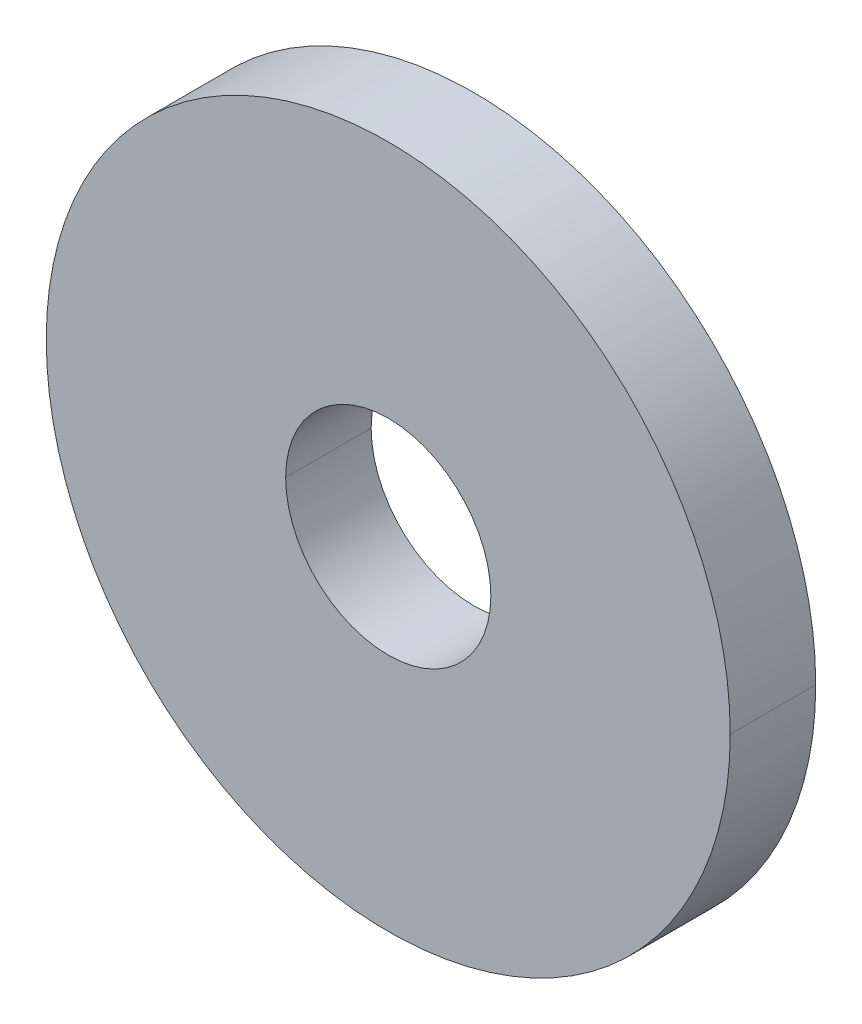
ISO-10303-21;
HEADER;
FILE_DESCRIPTION(('STEP AP214'),'2;1');
FILE_NAME('part.step','',(''),(''),'','','');
FILE_SCHEMA(('AUTOMOTIVE_DESIGN { 1 0 10303 214 1 1 1 1 }'));
ENDSEC;
DATA;
#1=APPLICATION_CONTEXT('core data for automotive mechanical design processes');
#2=APPLICATION_PROTOCOL_DEFINITION('international standard','automotive_design',2000,#1);
#3=PRODUCT_CONTEXT('',#1,'mechanical');
#4=PRODUCT('Part','Part','',(#3));
#5=PRODUCT_RELATED_PRODUCT_CATEGORY('part','',(#4));
#6=PRODUCT_DEFINITION_FORMATION('','',#4);
#7=PRODUCT_DEFINITION_CONTEXT('part definition',#1,'design');
#8=PRODUCT_DEFINITION('design','',#6,#7);
#9=PRODUCT_DEFINITION_SHAPE('','',#8);
#10=(LENGTH_UNIT() NAMED_UNIT(*) SI_UNIT(.MILLI.,.METRE.));
#11=(NAMED_UNIT(*) PLANE_ANGLE_UNIT() SI_UNIT($,.RADIAN.));
#12=(NAMED_UNIT(*) SI_UNIT($,.STERADIAN.) SOLID_ANGLE_UNIT());
#13=UNCERTAINTY_MEASURE_WITH_UNIT(LENGTH_MEASURE(1.E-05),#10,'distance_accuracy_value','');
#14=(GEOMETRIC_REPRESENTATION_CONTEXT(3) GLOBAL_UNCERTAINTY_ASSIGNED_CONTEXT((#13)) GLOBAL_UNIT_ASSIGNED_CONTEXT((#10,
#11,#12)) REPRESENTATION_CONTEXT('',''));
#15=CARTESIAN_POINT('',(0.,0.,0.));
#16=DIRECTION('',(0.,0.,1.));
#17=DIRECTION('',(1.,0.,0.));
#18=AXIS2_PLACEMENT_3D('',#15,#16,#17);
#19=CARTESIAN_POINT('',(0.,0.,0.999999999999883));
#20=DIRECTION('',(0.,0.,1.));
#21=DIRECTION('',(1.,0.,0.));
#22=AXIS2_PLACEMENT_3D('',#19,#20,#21);
#23=PLANE('',#22);
#24=CARTESIAN_POINT('',(0.,0.,0.999999999999883));
#25=DIRECTION('',(0.,0.,-1.));
#26=DIRECTION('',(-1.,0.,0.));
#27=AXIS2_PLACEMENT_3D('',#24,#25,#26);
#28=CIRCLE('',#27,1.2);
#29=CARTESIAN_POINT('',(-1.19999999999996,0.,0.999999999999883));
#30=VERTEX_POINT('',#29);
#31=CARTESIAN_POINT('',(1.20000000000004,0.,0.999999999999883));
#32=VERTEX_POINT('',#31);
#33=EDGE_CURVE('E11',#30,#32,#28,.T.);
#34=ORIENTED_EDGE('',*,*,#33,.T.);
#35=CARTESIAN_POINT('',(0.,0.,0.999999999999883));
#36=DIRECTION('',(0.,0.,-1.));
#37=DIRECTION('',(-1.,0.,0.));
#38=AXIS2_PLACEMENT_3D('',#35,#36,#37);
#39=CIRCLE('',#38,1.2);
#40=EDGE_CURVE('E100',#32,#30,#39,.T.);
#41=ORIENTED_EDGE('',*,*,#40,.T.);
#42=EDGE_LOOP('',(#34,#41));
#43=FACE_BOUND('',#42,.T.);
#44=CARTESIAN_POINT('',(0.,0.,0.999999999999883));
#45=DIRECTION('',(0.,0.,1.));
#46=DIRECTION('',(1.,0.,0.));
#47=AXIS2_PLACEMENT_3D('',#44,#45,#46);
#48=CIRCLE('',#47,4.);
#49=CARTESIAN_POINT('',(-3.99999999999996,0.,0.999999999999882));
#50=VERTEX_POINT('',#49);
#51=CARTESIAN_POINT('',(4.00000000000005,0.,0.999999999999884));
#52=VERTEX_POINT('',#51);
#53=EDGE_CURVE('E27',#50,#52,#48,.T.);
#54=ORIENTED_EDGE('',*,*,#53,.T.);
#55=CARTESIAN_POINT('',(0.,0.,0.999999999999883));
#56=DIRECTION('',(0.,0.,1.));
#57=DIRECTION('',(1.,0.,0.));
#58=AXIS2_PLACEMENT_3D('',#55,#56,#57);
#59=CIRCLE('',#58,4.);
#60=EDGE_CURVE('E89',#52,#50,#59,.T.);
#61=ORIENTED_EDGE('',*,*,#60,.T.);
#62=EDGE_LOOP('',(#54,#61));
#63=FACE_BOUND('',#62,.T.);
#64=ADVANCED_FACE('F17',(#43,#63),#23,.T.);
#65=CARTESIAN_POINT('',(0.,0.,0.9));
#66=DIRECTION('',(0.,0.,-1.));
#67=DIRECTION('',(-1.,0.,0.));
#68=AXIS2_PLACEMENT_3D('',#65,#66,#67);
#69=CYLINDRICAL_SURFACE('',#68,1.2);
#70=DIRECTION('',(0.,0.,-1.));
#71=VECTOR('',#70,1.);
#72=CARTESIAN_POINT('',(1.2,0.,0.9));
#73=LINE('',#72,#71);
#74=CARTESIAN_POINT('',(1.2,0.,0.));
#75=VERTEX_POINT('',#74);
#76=EDGE_CURVE('E92',#32,#75,#73,.T.);
#77=ORIENTED_EDGE('',*,*,#76,.F.);
#78=ORIENTED_EDGE('',*,*,#33,.F.);
#79=DIRECTION('',(0.,0.,-1.));
#80=VECTOR('',#79,1.);
#81=CARTESIAN_POINT('',(-1.2,0.,0.9));
#82=LINE('',#81,#80);
#83=CARTESIAN_POINT('',(-1.2,0.,0.));
#84=VERTEX_POINT('',#83);
#85=EDGE_CURVE('E83',#30,#84,#82,.T.);
#86=ORIENTED_EDGE('',*,*,#85,.T.);
#87=CARTESIAN_POINT('',(0.,0.,0.));
#88=DIRECTION('',(0.,0.,1.));
#89=DIRECTION('',(-1.,0.,0.));
#90=AXIS2_PLACEMENT_3D('',#87,#88,#89);
#91=CIRCLE('',#90,1.2);
#92=EDGE_CURVE('E73',#75,#84,#91,.T.);
#93=ORIENTED_EDGE('',*,*,#92,.F.);
#94=EDGE_LOOP('',(#77,#78,#86,#93));
#95=FACE_BOUND('',#94,.T.);
#96=ADVANCED_FACE('F84',(#95),#69,.F.);
#97=CARTESIAN_POINT('',(0.,0.,0.9));
#98=DIRECTION('',(0.,0.,-1.));
#99=DIRECTION('',(-1.,0.,0.));
#100=AXIS2_PLACEMENT_3D('',#97,#98,#99);
#101=CYLINDRICAL_SURFACE('',#100,4.);
#102=DIRECTION('',(0.,0.,-1.));
#103=VECTOR('',#102,1.);
#104=CARTESIAN_POINT('',(4.,0.,0.9));
#105=LINE('',#104,#103);
#106=CARTESIAN_POINT('',(4.,0.,0.));
#107=VERTEX_POINT('',#106);
#108=EDGE_CURVE('E108',#52,#107,#105,.T.);
#109=ORIENTED_EDGE('',*,*,#108,.F.);
#110=ORIENTED_EDGE('',*,*,#53,.F.);
#111=DIRECTION('',(0.,0.,-1.));
#112=VECTOR('',#111,1.);
#113=CARTESIAN_POINT('',(-4.,0.,0.9));
#114=LINE('',#113,#112);
#115=CARTESIAN_POINT('',(-4.,0.,0.));
#116=VERTEX_POINT('',#115);
#117=EDGE_CURVE('E107',#50,#116,#114,.T.);
#118=ORIENTED_EDGE('',*,*,#117,.T.);
#119=CARTESIAN_POINT('',(0.,0.,0.));
#120=DIRECTION('',(0.,0.,1.));
#121=DIRECTION('',(1.,0.,0.));
#122=AXIS2_PLACEMENT_3D('',#119,#120,#121);
#123=CIRCLE('',#122,4.);
#124=EDGE_CURVE('E21',#116,#107,#123,.T.);
#125=ORIENTED_EDGE('',*,*,#124,.T.);
#126=EDGE_LOOP('',(#109,#110,#118,#125));
#127=FACE_BOUND('',#126,.T.);
#128=ADVANCED_FACE('F155',(#127),#101,.T.);
#129=CARTESIAN_POINT('',(0.,0.,0.));
#130=DIRECTION('',(0.,0.,1.));
#131=DIRECTION('',(1.,0.,0.));
#132=AXIS2_PLACEMENT_3D('',#129,#130,#131);
#133=PLANE('',#132);
#134=CARTESIAN_POINT('',(0.,0.,0.));
#135=DIRECTION('',(0.,0.,1.));
#136=DIRECTION('',(-1.,0.,0.));
#137=AXIS2_PLACEMENT_3D('',#134,#135,#136);
#138=CIRCLE('',#137,1.2);
#139=EDGE_CURVE('E76',#84,#75,#138,.T.);
#140=ORIENTED_EDGE('',*,*,#139,.T.);
#141=ORIENTED_EDGE('',*,*,#92,.T.);
#142=EDGE_LOOP('',(#140,#141));
#143=FACE_BOUND('',#142,.T.);
#144=ORIENTED_EDGE('',*,*,#124,.F.);
#145=CARTESIAN_POINT('',(0.,0.,0.));
#146=DIRECTION('',(0.,0.,1.));
#147=DIRECTION('',(1.,0.,0.));
#148=AXIS2_PLACEMENT_3D('',#145,#146,#147);
#149=CIRCLE('',#148,4.);
#150=EDGE_CURVE('E105',#107,#116,#149,.T.);
#151=ORIENTED_EDGE('',*,*,#150,.F.);
#152=EDGE_LOOP('',(#144,#151));
#153=FACE_BOUND('',#152,.T.);
#154=ADVANCED_FACE('F19',(#143,#153),#133,.F.);
#155=CARTESIAN_POINT('',(0.,0.,0.9));
#156=DIRECTION('',(0.,0.,-1.));
#157=DIRECTION('',(-1.,0.,0.));
#158=AXIS2_PLACEMENT_3D('',#155,#156,#157);
#159=CYLINDRICAL_SURFACE('',#158,4.);
#160=ORIENTED_EDGE('',*,*,#60,.F.);
#161=ORIENTED_EDGE('',*,*,#108,.T.);
#162=ORIENTED_EDGE('',*,*,#150,.T.);
#163=ORIENTED_EDGE('',*,*,#117,.F.);
#164=EDGE_LOOP('',(#160,#161,#162,#163));
#165=FACE_BOUND('',#164,.T.);
#166=ADVANCED_FACE('F122',(#165),#159,.T.);
#167=CARTESIAN_POINT('',(0.,0.,0.9));
#168=DIRECTION('',(0.,0.,-1.));
#169=DIRECTION('',(-1.,0.,0.));
#170=AXIS2_PLACEMENT_3D('',#167,#168,#169);
#171=CYLINDRICAL_SURFACE('',#170,1.2);
#172=ORIENTED_EDGE('',*,*,#40,.F.);
#173=ORIENTED_EDGE('',*,*,#76,.T.);
#174=ORIENTED_EDGE('',*,*,#139,.F.);
#175=ORIENTED_EDGE('',*,*,#85,.F.);
#176=EDGE_LOOP('',(#172,#173,#174,#175));
#177=FACE_BOUND('',#176,.T.);
#178=ADVANCED_FACE('F91',(#177),#171,.F.);
#179=CLOSED_SHELL('',(#64,#96,#128,#154,#166,#178));
#180=MANIFOLD_SOLID_BREP('B1',#179);
#181=ADVANCED_BREP_SHAPE_REPRESENTATION('',(#18,#180),#14);
#182=SHAPE_DEFINITION_REPRESENTATION(#9,#181);
ENDSEC;
END-ISO-10303-21;
